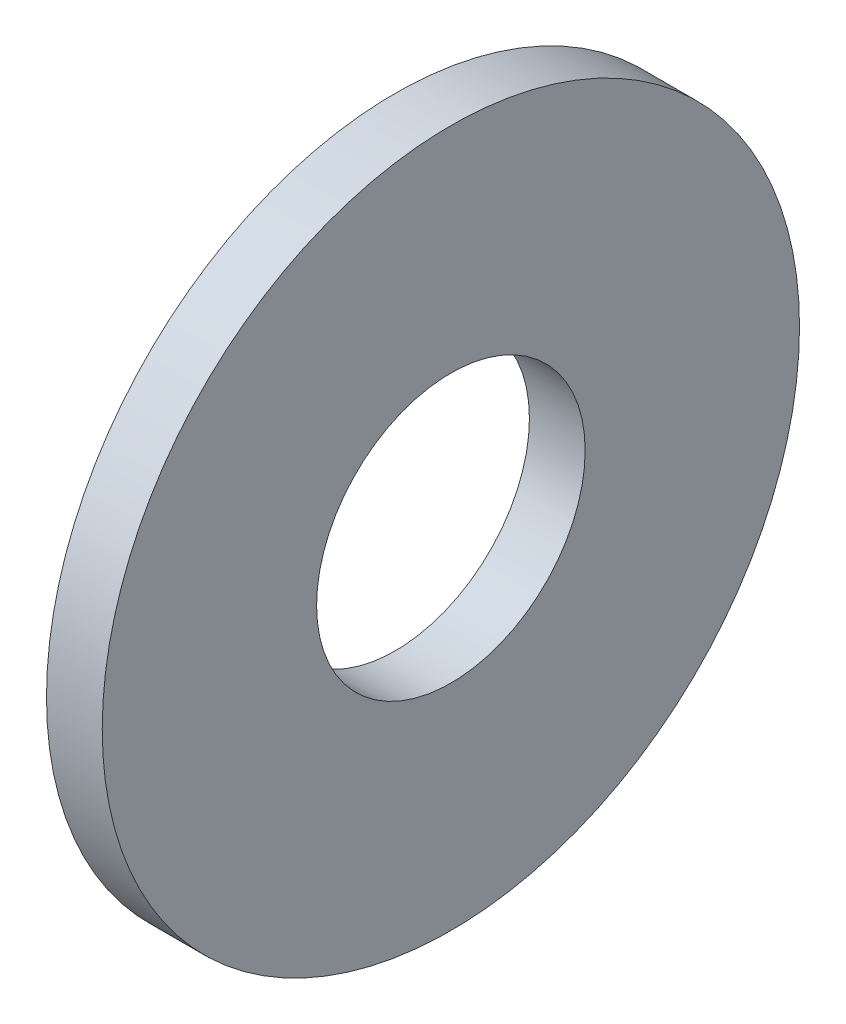
ISO-10303-21;
HEADER;
FILE_DESCRIPTION(('STEP AP214'),'2;1');
FILE_NAME('part.step','',(''),(''),'','','');
FILE_SCHEMA(('AUTOMOTIVE_DESIGN { 1 0 10303 214 1 1 1 1 }'));
ENDSEC;
DATA;
#1=APPLICATION_CONTEXT('core data for automotive mechanical design processes');
#2=APPLICATION_PROTOCOL_DEFINITION('international standard','automotive_design',2000,#1);
#3=PRODUCT_CONTEXT('',#1,'mechanical');
#4=PRODUCT('Part','Part','',(#3));
#5=PRODUCT_RELATED_PRODUCT_CATEGORY('part','',(#4));
#6=PRODUCT_DEFINITION_FORMATION('','',#4);
#7=PRODUCT_DEFINITION_CONTEXT('part definition',#1,'design');
#8=PRODUCT_DEFINITION('design','',#6,#7);
#9=PRODUCT_DEFINITION_SHAPE('','',#8);
#10=(LENGTH_UNIT() NAMED_UNIT(*) SI_UNIT(.MILLI.,.METRE.));
#11=(NAMED_UNIT(*) PLANE_ANGLE_UNIT() SI_UNIT($,.RADIAN.));
#12=(NAMED_UNIT(*) SI_UNIT($,.STERADIAN.) SOLID_ANGLE_UNIT());
#13=UNCERTAINTY_MEASURE_WITH_UNIT(LENGTH_MEASURE(1.E-05),#10,'distance_accuracy_value','');
#14=(GEOMETRIC_REPRESENTATION_CONTEXT(3) GLOBAL_UNCERTAINTY_ASSIGNED_CONTEXT((#13)) GLOBAL_UNIT_ASSIGNED_CONTEXT((#10,
#11,#12)) REPRESENTATION_CONTEXT('',''));
#15=CARTESIAN_POINT('',(0.,0.,0.));
#16=DIRECTION('',(0.,0.,1.));
#17=DIRECTION('',(1.,0.,0.));
#18=AXIS2_PLACEMENT_3D('',#15,#16,#17);
#19=CARTESIAN_POINT('',(1.397,0.,0.));
#20=DIRECTION('',(1.,0.,0.));
#21=DIRECTION('',(0.,0.,-1.));
#22=AXIS2_PLACEMENT_3D('',#19,#20,#21);
#23=PLANE('',#22);
#24=CARTESIAN_POINT('',(1.397,0.,0.));
#25=DIRECTION('',(1.,0.,0.));
#26=DIRECTION('',(0.,0.,-1.));
#27=AXIS2_PLACEMENT_3D('',#24,#25,#26);
#28=CIRCLE('',#27,8.7376);
#29=CARTESIAN_POINT('',(1.397,0.,-8.7376));
#30=VERTEX_POINT('',#29);
#31=EDGE_CURVE('E10',#30,#30,#28,.T.);
#32=ORIENTED_EDGE('',*,*,#31,.T.);
#33=EDGE_LOOP('',(#32));
#34=FACE_BOUND('',#33,.T.);
#35=CARTESIAN_POINT('',(1.397,0.,0.));
#36=DIRECTION('',(1.,0.,0.));
#37=DIRECTION('',(0.,0.,-1.));
#38=AXIS2_PLACEMENT_3D('',#35,#36,#37);
#39=CIRCLE('',#38,3.3655);
#40=CARTESIAN_POINT('',(1.397,0.,-3.3655));
#41=VERTEX_POINT('',#40);
#42=EDGE_CURVE('E43',#41,#41,#39,.T.);
#43=ORIENTED_EDGE('',*,*,#42,.F.);
#44=EDGE_LOOP('',(#43));
#45=FACE_BOUND('',#44,.T.);
#46=ADVANCED_FACE('F32',(#34,#45),#23,.T.);
#47=CARTESIAN_POINT('',(0.,0.,0.));
#48=DIRECTION('',(1.,0.,0.));
#49=DIRECTION('',(0.,0.,-1.));
#50=AXIS2_PLACEMENT_3D('',#47,#48,#49);
#51=PLANE('',#50);
#52=CARTESIAN_POINT('',(0.,0.,0.));
#53=DIRECTION('',(1.,0.,0.));
#54=DIRECTION('',(0.,0.,-1.));
#55=AXIS2_PLACEMENT_3D('',#52,#53,#54);
#56=CIRCLE('',#55,8.7376);
#57=CARTESIAN_POINT('',(0.,0.,-8.7376));
#58=VERTEX_POINT('',#57);
#59=EDGE_CURVE('E36',#58,#58,#56,.T.);
#60=ORIENTED_EDGE('',*,*,#59,.F.);
#61=EDGE_LOOP('',(#60));
#62=FACE_BOUND('',#61,.T.);
#63=CARTESIAN_POINT('',(0.,0.,0.));
#64=DIRECTION('',(1.,0.,0.));
#65=DIRECTION('',(0.,0.,-1.));
#66=AXIS2_PLACEMENT_3D('',#63,#64,#65);
#67=CIRCLE('',#66,3.3655);
#68=CARTESIAN_POINT('',(0.,0.,-3.3655));
#69=VERTEX_POINT('',#68);
#70=EDGE_CURVE('E45',#69,#69,#67,.T.);
#71=ORIENTED_EDGE('',*,*,#70,.T.);
#72=EDGE_LOOP('',(#71));
#73=FACE_BOUND('',#72,.T.);
#74=ADVANCED_FACE('F55',(#62,#73),#51,.F.);
#75=CARTESIAN_POINT('',(1.397,0.,0.));
#76=DIRECTION('',(-1.,0.,0.));
#77=DIRECTION('',(0.,0.,1.));
#78=AXIS2_PLACEMENT_3D('',#75,#76,#77);
#79=CYLINDRICAL_SURFACE('',#78,8.7376);
#80=ORIENTED_EDGE('',*,*,#31,.F.);
#81=EDGE_LOOP('',(#80));
#82=FACE_BOUND('',#81,.T.);
#83=ORIENTED_EDGE('',*,*,#59,.T.);
#84=EDGE_LOOP('',(#83));
#85=FACE_BOUND('',#84,.T.);
#86=ADVANCED_FACE('F34',(#82,#85),#79,.T.);
#87=CARTESIAN_POINT('',(1.397,0.,0.));
#88=DIRECTION('',(-1.,0.,0.));
#89=DIRECTION('',(0.,0.,1.));
#90=AXIS2_PLACEMENT_3D('',#87,#88,#89);
#91=CYLINDRICAL_SURFACE('',#90,3.3655);
#92=ORIENTED_EDGE('',*,*,#42,.T.);
#93=EDGE_LOOP('',(#92));
#94=FACE_BOUND('',#93,.T.);
#95=ORIENTED_EDGE('',*,*,#70,.F.);
#96=EDGE_LOOP('',(#95));
#97=FACE_BOUND('',#96,.T.);
#98=ADVANCED_FACE('F51',(#94,#97),#91,.F.);
#99=CLOSED_SHELL('',(#46,#74,#86,#98));
#100=MANIFOLD_SOLID_BREP('B2',#99);
#101=ADVANCED_BREP_SHAPE_REPRESENTATION('',(#18,#100),#14);
#102=SHAPE_DEFINITION_REPRESENTATION(#9,#101);
ENDSEC;
END-ISO-10303-21;
